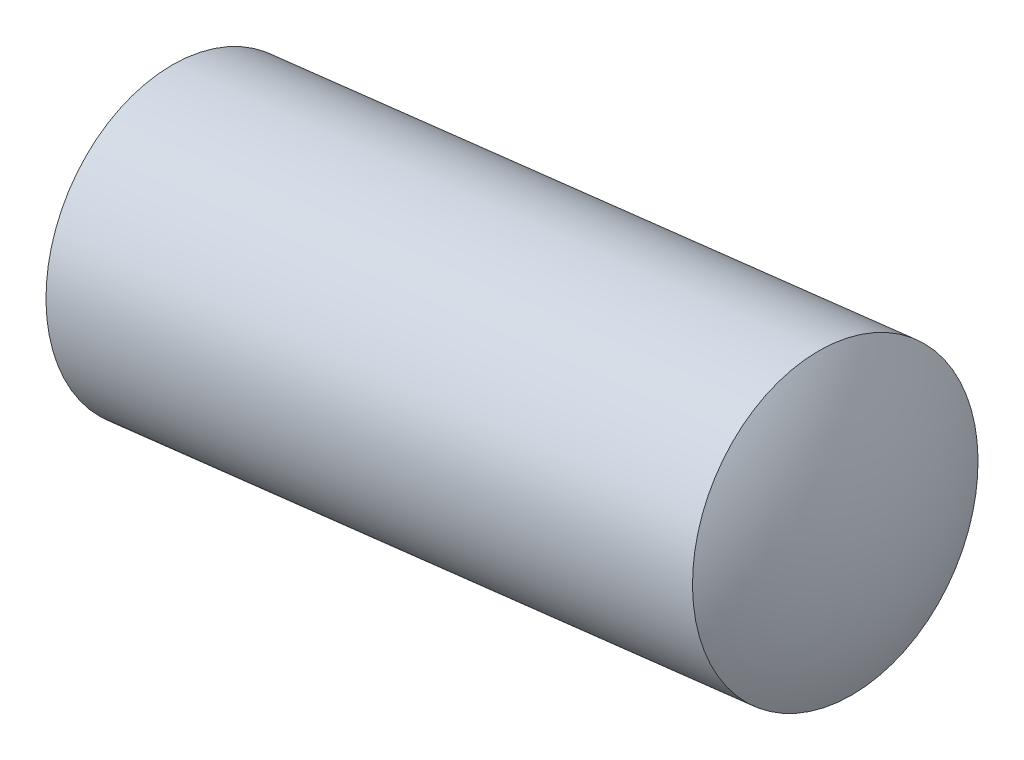
ISO-10303-21;
HEADER;
FILE_DESCRIPTION(('STEP AP214'),'2;1');
FILE_NAME('part.step','',(''),(''),'','','');
FILE_SCHEMA(('AUTOMOTIVE_DESIGN { 1 0 10303 214 1 1 1 1 }'));
ENDSEC;
DATA;
#1=APPLICATION_CONTEXT('core data for automotive mechanical design processes');
#2=APPLICATION_PROTOCOL_DEFINITION('international standard','automotive_design',2000,#1);
#3=PRODUCT_CONTEXT('',#1,'mechanical');
#4=PRODUCT('Part','Part','',(#3));
#5=PRODUCT_RELATED_PRODUCT_CATEGORY('part','',(#4));
#6=PRODUCT_DEFINITION_FORMATION('','',#4);
#7=PRODUCT_DEFINITION_CONTEXT('part definition',#1,'design');
#8=PRODUCT_DEFINITION('design','',#6,#7);
#9=PRODUCT_DEFINITION_SHAPE('','',#8);
#10=(LENGTH_UNIT() NAMED_UNIT(*) SI_UNIT(.MILLI.,.METRE.));
#11=(NAMED_UNIT(*) PLANE_ANGLE_UNIT() SI_UNIT($,.RADIAN.));
#12=(NAMED_UNIT(*) SI_UNIT($,.STERADIAN.) SOLID_ANGLE_UNIT());
#13=UNCERTAINTY_MEASURE_WITH_UNIT(LENGTH_MEASURE(1.E-05),#10,'distance_accuracy_value','');
#14=(GEOMETRIC_REPRESENTATION_CONTEXT(3) GLOBAL_UNCERTAINTY_ASSIGNED_CONTEXT((#13)) GLOBAL_UNIT_ASSIGNED_CONTEXT((#10,
#11,#12)) REPRESENTATION_CONTEXT('',''));
#15=CARTESIAN_POINT('',(0.,0.,0.));
#16=DIRECTION('',(0.,0.,1.));
#17=DIRECTION('',(1.,0.,0.));
#18=AXIS2_PLACEMENT_3D('',#15,#16,#17);
#19=CARTESIAN_POINT('',(-22.161732617811,-2.59332008064262,0.6));
#20=DIRECTION('',(-0.116224890680176,0.993222923006906,0.));
#21=DIRECTION('',(-0.993222923006905,-0.116224890680177,0.));
#22=AXIS2_PLACEMENT_3D('',#19,#20,#21);
#23=SPHERICAL_SURFACE('',#22,2.);
#24=CARTESIAN_POINT('',(-22.161732617811,-2.59332008064262,0.6));
#25=DIRECTION('',(0.993222923006905,0.116224890680177,0.));
#26=DIRECTION('',(0.,0.,-1.));
#27=AXIS2_PLACEMENT_3D('',#24,#25,#26);
#28=SPHERICAL_SURFACE('',#27,2.);
#29=CARTESIAN_POINT('',(-23.882045183701,-2.7946274964048,0.6));
#30=DIRECTION('',(0.993222923006905,0.116224890680177,0.));
#31=DIRECTION('',(0.,0.,-1.));
#32=AXIS2_PLACEMENT_3D('',#29,#30,#31);
#33=CIRCLE('',#32,1.);
#34=CARTESIAN_POINT('',(-23.882045183701,-2.7946274964048,-0.4));
#35=VERTEX_POINT('',#34);
#36=EDGE_CURVE('E11',#35,#35,#33,.T.);
#37=ORIENTED_EDGE('',*,*,#36,.F.);
#38=EDGE_LOOP('',(#37));
#39=FACE_BOUND('',#38,.T.);
#40=ADVANCED_FACE('F17',(#39),#28,.T.);
#41=CARTESIAN_POINT('',(-21.0434645329894,-2.46246266394512,0.6));
#42=DIRECTION('',(-0.116224890680177,0.993222923006905,0.));
#43=DIRECTION('',(0.993222923006905,0.116224890680177,0.));
#44=AXIS2_PLACEMENT_3D('',#41,#42,#43);
#45=SPHERICAL_SURFACE('',#44,2.);
#46=CARTESIAN_POINT('',(-21.0434645329894,-2.46246266394512,0.6));
#47=DIRECTION('',(0.993222923006905,0.116224890680177,0.));
#48=DIRECTION('',(0.,0.,-1.));
#49=AXIS2_PLACEMENT_3D('',#46,#47,#48);
#50=SPHERICAL_SURFACE('',#49,2.);
#51=CARTESIAN_POINT('',(-19.3231519670993,-2.26115524818282,0.6));
#52=DIRECTION('',(0.993222923006905,0.116224890680177,0.));
#53=DIRECTION('',(0.,0.,-1.));
#54=AXIS2_PLACEMENT_3D('',#51,#52,#53);
#55=CIRCLE('',#54,1.);
#56=CARTESIAN_POINT('',(-19.3231519670993,-2.26115524818282,-0.4));
#57=VERTEX_POINT('',#56);
#58=EDGE_CURVE('E21',#57,#57,#55,.T.);
#59=ORIENTED_EDGE('',*,*,#58,.T.);
#60=EDGE_LOOP('',(#59));
#61=FACE_BOUND('',#60,.T.);
#62=ADVANCED_FACE('F40',(#61),#50,.T.);
#63=CARTESIAN_POINT('',(-20.4628752712498,-2.39452331023837,0.6));
#64=DIRECTION('',(0.993222923006905,0.116224890680177,0.));
#65=DIRECTION('',(0.,0.,-1.));
#66=AXIS2_PLACEMENT_3D('',#63,#64,#65);
#67=CYLINDRICAL_SURFACE('',#66,1.);
#68=ORIENTED_EDGE('',*,*,#36,.T.);
#69=EDGE_LOOP('',(#68));
#70=FACE_BOUND('',#69,.T.);
#71=ORIENTED_EDGE('',*,*,#58,.F.);
#72=EDGE_LOOP('',(#71));
#73=FACE_BOUND('',#72,.T.);
#74=ADVANCED_FACE('F19',(#70,#73),#67,.T.);
#75=CLOSED_SHELL('',(#40,#62,#74));
#76=MANIFOLD_SOLID_BREP('B1',#75);
#77=ADVANCED_BREP_SHAPE_REPRESENTATION('',(#18,#76),#14);
#78=SHAPE_DEFINITION_REPRESENTATION(#9,#77);
ENDSEC;
END-ISO-10303-21;
